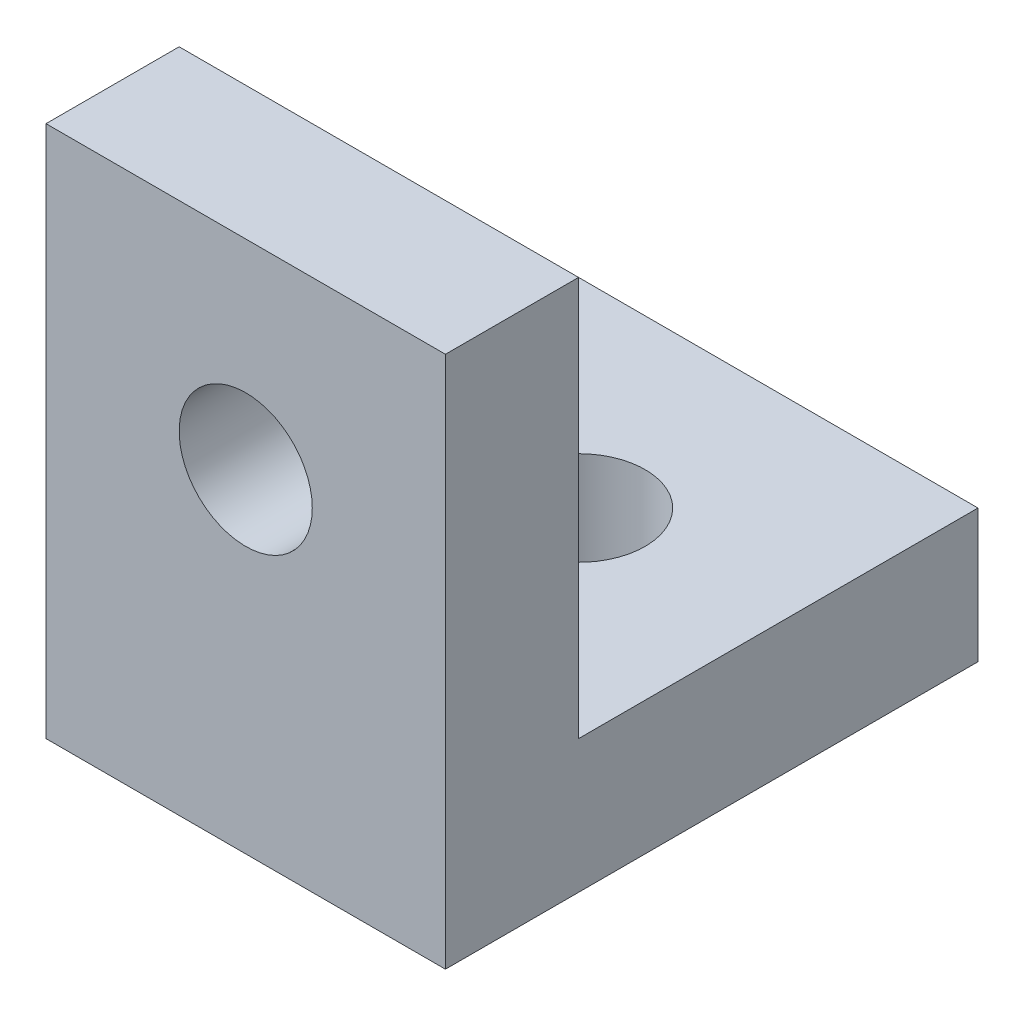
ISO-10303-21;
HEADER;
FILE_DESCRIPTION(('STEP AP214'),'2;1');
FILE_NAME('part.step','',(''),(''),'','','');
FILE_SCHEMA(('AUTOMOTIVE_DESIGN { 1 0 10303 214 1 1 1 1 }'));
ENDSEC;
DATA;
#1=APPLICATION_CONTEXT('core data for automotive mechanical design processes');
#2=APPLICATION_PROTOCOL_DEFINITION('international standard','automotive_design',2000,#1);
#3=PRODUCT_CONTEXT('',#1,'mechanical');
#4=PRODUCT('Part','Part','',(#3));
#5=PRODUCT_RELATED_PRODUCT_CATEGORY('part','',(#4));
#6=PRODUCT_DEFINITION_FORMATION('','',#4);
#7=PRODUCT_DEFINITION_CONTEXT('part definition',#1,'design');
#8=PRODUCT_DEFINITION('design','',#6,#7);
#9=PRODUCT_DEFINITION_SHAPE('','',#8);
#10=(LENGTH_UNIT() NAMED_UNIT(*) SI_UNIT(.MILLI.,.METRE.));
#11=(NAMED_UNIT(*) PLANE_ANGLE_UNIT() SI_UNIT($,.RADIAN.));
#12=(NAMED_UNIT(*) SI_UNIT($,.STERADIAN.) SOLID_ANGLE_UNIT());
#13=UNCERTAINTY_MEASURE_WITH_UNIT(LENGTH_MEASURE(1.E-05),#10,'distance_accuracy_value','');
#14=(GEOMETRIC_REPRESENTATION_CONTEXT(3) GLOBAL_UNCERTAINTY_ASSIGNED_CONTEXT((#13)) GLOBAL_UNIT_ASSIGNED_CONTEXT((#10,
#11,#12)) REPRESENTATION_CONTEXT('',''));
#15=CARTESIAN_POINT('',(0.,0.,0.));
#16=DIRECTION('',(0.,0.,1.));
#17=DIRECTION('',(1.,0.,0.));
#18=AXIS2_PLACEMENT_3D('',#15,#16,#17);
#19=CARTESIAN_POINT('',(0.,10.,0.));
#20=DIRECTION('',(1.,0.,0.));
#21=DIRECTION('',(0.,0.,-1.));
#22=AXIS2_PLACEMENT_3D('',#19,#20,#21);
#23=PLANE('',#22);
#24=DIRECTION('',(0.,0.,1.));
#25=VECTOR('',#24,1.);
#26=CARTESIAN_POINT('',(0.,0.,0.));
#27=LINE('',#26,#25);
#28=CARTESIAN_POINT('',(0.,0.,-30.));
#29=VERTEX_POINT('',#28);
#30=CARTESIAN_POINT('',(0.,0.,9.99999999999999));
#31=VERTEX_POINT('',#30);
#32=EDGE_CURVE('E113',#29,#31,#27,.T.);
#33=ORIENTED_EDGE('',*,*,#32,.T.);
#34=DIRECTION('',(0.,-1.,0.));
#35=VECTOR('',#34,1.);
#36=CARTESIAN_POINT('',(0.,0.,9.99999999999999));
#37=LINE('',#36,#35);
#38=CARTESIAN_POINT('',(0.,40.,10.));
#39=VERTEX_POINT('',#38);
#40=EDGE_CURVE('E143',#39,#31,#37,.T.);
#41=ORIENTED_EDGE('',*,*,#40,.F.);
#42=DIRECTION('',(0.,0.,-1.));
#43=VECTOR('',#42,1.);
#44=CARTESIAN_POINT('',(0.,40.,10.));
#45=LINE('',#44,#43);
#46=CARTESIAN_POINT('',(0.,40.,0.));
#47=VERTEX_POINT('',#46);
#48=EDGE_CURVE('E163',#39,#47,#45,.T.);
#49=ORIENTED_EDGE('',*,*,#48,.T.);
#50=DIRECTION('',(0.,-1.,0.));
#51=VECTOR('',#50,1.);
#52=CARTESIAN_POINT('',(0.,0.,0.));
#53=LINE('',#52,#51);
#54=CARTESIAN_POINT('',(0.,10.,0.));
#55=VERTEX_POINT('',#54);
#56=EDGE_CURVE('E97',#47,#55,#53,.T.);
#57=ORIENTED_EDGE('',*,*,#56,.T.);
#58=DIRECTION('',(0.,0.,1.));
#59=VECTOR('',#58,1.);
#60=CARTESIAN_POINT('',(0.,10.,0.));
#61=LINE('',#60,#59);
#62=CARTESIAN_POINT('',(0.,10.,-30.));
#63=VERTEX_POINT('',#62);
#64=EDGE_CURVE('E102',#63,#55,#61,.T.);
#65=ORIENTED_EDGE('',*,*,#64,.F.);
#66=DIRECTION('',(0.,-1.,0.));
#67=VECTOR('',#66,1.);
#68=CARTESIAN_POINT('',(0.,10.,-30.));
#69=LINE('',#68,#67);
#70=EDGE_CURVE('E49',#63,#29,#69,.T.);
#71=ORIENTED_EDGE('',*,*,#70,.T.);
#72=EDGE_LOOP('',(#33,#41,#49,#57,#65,#71));
#73=FACE_BOUND('',#72,.T.);
#74=ADVANCED_FACE('F40',(#73),#23,.F.);
#75=CARTESIAN_POINT('',(30.,10.,0.));
#76=DIRECTION('',(-1.,0.,0.));
#77=DIRECTION('',(0.,0.,1.));
#78=AXIS2_PLACEMENT_3D('',#75,#76,#77);
#79=PLANE('',#78);
#80=DIRECTION('',(0.,0.,-1.));
#81=VECTOR('',#80,1.);
#82=CARTESIAN_POINT('',(30.,0.,0.));
#83=LINE('',#82,#81);
#84=CARTESIAN_POINT('',(30.,0.,9.99999999999999));
#85=VERTEX_POINT('',#84);
#86=CARTESIAN_POINT('',(30.,0.,-30.));
#87=VERTEX_POINT('',#86);
#88=EDGE_CURVE('E69',#85,#87,#83,.T.);
#89=ORIENTED_EDGE('',*,*,#88,.T.);
#90=DIRECTION('',(0.,-1.,0.));
#91=VECTOR('',#90,1.);
#92=CARTESIAN_POINT('',(30.,10.,-30.));
#93=LINE('',#92,#91);
#94=CARTESIAN_POINT('',(30.,10.,-30.));
#95=VERTEX_POINT('',#94);
#96=EDGE_CURVE('E11',#95,#87,#93,.T.);
#97=ORIENTED_EDGE('',*,*,#96,.F.);
#98=DIRECTION('',(0.,0.,-1.));
#99=VECTOR('',#98,1.);
#100=CARTESIAN_POINT('',(30.,10.,0.));
#101=LINE('',#100,#99);
#102=CARTESIAN_POINT('',(30.,10.,0.));
#103=VERTEX_POINT('',#102);
#104=EDGE_CURVE('E100',#103,#95,#101,.T.);
#105=ORIENTED_EDGE('',*,*,#104,.F.);
#106=DIRECTION('',(0.,1.,0.));
#107=VECTOR('',#106,1.);
#108=CARTESIAN_POINT('',(30.,0.,0.));
#109=LINE('',#108,#107);
#110=CARTESIAN_POINT('',(30.,40.,0.));
#111=VERTEX_POINT('',#110);
#112=EDGE_CURVE('E88',#103,#111,#109,.T.);
#113=ORIENTED_EDGE('',*,*,#112,.T.);
#114=DIRECTION('',(0.,0.,-1.));
#115=VECTOR('',#114,1.);
#116=CARTESIAN_POINT('',(30.,40.,10.));
#117=LINE('',#116,#115);
#118=CARTESIAN_POINT('',(30.,40.,10.));
#119=VERTEX_POINT('',#118);
#120=EDGE_CURVE('E117',#119,#111,#117,.T.);
#121=ORIENTED_EDGE('',*,*,#120,.F.);
#122=DIRECTION('',(0.,1.,0.));
#123=VECTOR('',#122,1.);
#124=CARTESIAN_POINT('',(30.,0.,9.99999999999999));
#125=LINE('',#124,#123);
#126=EDGE_CURVE('E142',#85,#119,#125,.T.);
#127=ORIENTED_EDGE('',*,*,#126,.F.);
#128=EDGE_LOOP('',(#89,#97,#105,#113,#121,#127));
#129=FACE_BOUND('',#128,.T.);
#130=ADVANCED_FACE('F105',(#129),#79,.F.);
#131=CARTESIAN_POINT('',(0.,10.,-30.));
#132=DIRECTION('',(0.,0.,1.));
#133=DIRECTION('',(1.,0.,0.));
#134=AXIS2_PLACEMENT_3D('',#131,#132,#133);
#135=PLANE('',#134);
#136=DIRECTION('',(-1.,0.,0.));
#137=VECTOR('',#136,1.);
#138=CARTESIAN_POINT('',(0.,0.,-30.));
#139=LINE('',#138,#137);
#140=EDGE_CURVE('E120',#87,#29,#139,.T.);
#141=ORIENTED_EDGE('',*,*,#140,.T.);
#142=ORIENTED_EDGE('',*,*,#70,.F.);
#143=DIRECTION('',(-1.,0.,0.));
#144=VECTOR('',#143,1.);
#145=CARTESIAN_POINT('',(0.,10.,-30.));
#146=LINE('',#145,#144);
#147=EDGE_CURVE('E57',#95,#63,#146,.T.);
#148=ORIENTED_EDGE('',*,*,#147,.F.);
#149=ORIENTED_EDGE('',*,*,#96,.T.);
#150=EDGE_LOOP('',(#141,#142,#148,#149));
#151=FACE_BOUND('',#150,.T.);
#152=ADVANCED_FACE('F201',(#151),#135,.F.);
#153=CARTESIAN_POINT('',(0.,10.,0.));
#154=DIRECTION('',(0.,-1.,0.));
#155=DIRECTION('',(0.,0.,-1.));
#156=AXIS2_PLACEMENT_3D('',#153,#154,#155);
#157=PLANE('',#156);
#158=CARTESIAN_POINT('',(15.,10.,-15.));
#159=DIRECTION('',(0.,1.,0.));
#160=DIRECTION('',(0.,0.,1.));
#161=AXIS2_PLACEMENT_3D('',#158,#159,#160);
#162=CIRCLE('',#161,5.);
#163=CARTESIAN_POINT('',(15.,10.,-10.));
#164=VERTEX_POINT('',#163);
#165=EDGE_CURVE('E215',#164,#164,#162,.T.);
#166=ORIENTED_EDGE('',*,*,#165,.F.);
#167=EDGE_LOOP('',(#166));
#168=FACE_BOUND('',#167,.T.);
#169=ORIENTED_EDGE('',*,*,#64,.T.);
#170=DIRECTION('',(1.,0.,0.));
#171=VECTOR('',#170,1.);
#172=CARTESIAN_POINT('',(0.,10.,0.));
#173=LINE('',#172,#171);
#174=EDGE_CURVE('E78',#55,#103,#173,.T.);
#175=ORIENTED_EDGE('',*,*,#174,.T.);
#176=ORIENTED_EDGE('',*,*,#104,.T.);
#177=ORIENTED_EDGE('',*,*,#147,.T.);
#178=EDGE_LOOP('',(#169,#175,#176,#177));
#179=FACE_BOUND('',#178,.T.);
#180=ADVANCED_FACE('F99',(#168,#179),#157,.F.);
#181=CARTESIAN_POINT('',(0.,0.,0.));
#182=DIRECTION('',(0.,-1.,0.));
#183=DIRECTION('',(0.,0.,-1.));
#184=AXIS2_PLACEMENT_3D('',#181,#182,#183);
#185=PLANE('',#184);
#186=CARTESIAN_POINT('',(15.,0.,-15.));
#187=DIRECTION('',(0.,1.,0.));
#188=DIRECTION('',(0.,0.,1.));
#189=AXIS2_PLACEMENT_3D('',#186,#187,#188);
#190=CIRCLE('',#189,5.);
#191=CARTESIAN_POINT('',(15.,0.,-10.));
#192=VERTEX_POINT('',#191);
#193=EDGE_CURVE('E218',#192,#192,#190,.T.);
#194=ORIENTED_EDGE('',*,*,#193,.T.);
#195=EDGE_LOOP('',(#194));
#196=FACE_BOUND('',#195,.T.);
#197=ORIENTED_EDGE('',*,*,#32,.F.);
#198=ORIENTED_EDGE('',*,*,#140,.F.);
#199=ORIENTED_EDGE('',*,*,#88,.F.);
#200=DIRECTION('',(1.,0.,0.));
#201=VECTOR('',#200,1.);
#202=CARTESIAN_POINT('',(0.,0.,9.99999999999999));
#203=LINE('',#202,#201);
#204=EDGE_CURVE('E135',#31,#85,#203,.T.);
#205=ORIENTED_EDGE('',*,*,#204,.F.);
#206=EDGE_LOOP('',(#197,#198,#199,#205));
#207=FACE_BOUND('',#206,.T.);
#208=ADVANCED_FACE('F133',(#196,#207),#185,.T.);
#209=CARTESIAN_POINT('',(0.,0.,0.));
#210=DIRECTION('',(0.,0.,-1.));
#211=DIRECTION('',(-1.,0.,0.));
#212=AXIS2_PLACEMENT_3D('',#209,#210,#211);
#213=PLANE('',#212);
#214=CARTESIAN_POINT('',(15.,25.,0.));
#215=DIRECTION('',(0.,0.,1.));
#216=DIRECTION('',(1.,0.,0.));
#217=AXIS2_PLACEMENT_3D('',#214,#215,#216);
#218=CIRCLE('',#217,5.);
#219=CARTESIAN_POINT('',(20.,25.,0.));
#220=VERTEX_POINT('',#219);
#221=EDGE_CURVE('E165',#220,#220,#218,.T.);
#222=ORIENTED_EDGE('',*,*,#221,.T.);
#223=EDGE_LOOP('',(#222));
#224=FACE_BOUND('',#223,.T.);
#225=ORIENTED_EDGE('',*,*,#174,.F.);
#226=ORIENTED_EDGE('',*,*,#56,.F.);
#227=DIRECTION('',(-1.,0.,0.));
#228=VECTOR('',#227,1.);
#229=CARTESIAN_POINT('',(0.,40.,0.));
#230=LINE('',#229,#228);
#231=EDGE_CURVE('E92',#111,#47,#230,.T.);
#232=ORIENTED_EDGE('',*,*,#231,.F.);
#233=ORIENTED_EDGE('',*,*,#112,.F.);
#234=EDGE_LOOP('',(#225,#226,#232,#233));
#235=FACE_BOUND('',#234,.T.);
#236=ADVANCED_FACE('F89',(#224,#235),#213,.T.);
#237=CARTESIAN_POINT('',(0.,40.,10.));
#238=DIRECTION('',(0.,-1.,0.));
#239=DIRECTION('',(0.,0.,-1.));
#240=AXIS2_PLACEMENT_3D('',#237,#238,#239);
#241=PLANE('',#240);
#242=ORIENTED_EDGE('',*,*,#231,.T.);
#243=ORIENTED_EDGE('',*,*,#48,.F.);
#244=DIRECTION('',(-1.,0.,0.));
#245=VECTOR('',#244,1.);
#246=CARTESIAN_POINT('',(0.,40.,10.));
#247=LINE('',#246,#245);
#248=EDGE_CURVE('E147',#119,#39,#247,.T.);
#249=ORIENTED_EDGE('',*,*,#248,.F.);
#250=ORIENTED_EDGE('',*,*,#120,.T.);
#251=EDGE_LOOP('',(#242,#243,#249,#250));
#252=FACE_BOUND('',#251,.T.);
#253=ADVANCED_FACE('F182',(#252),#241,.F.);
#254=CARTESIAN_POINT('',(0.,0.,9.99999999999999));
#255=DIRECTION('',(0.,0.,-1.));
#256=DIRECTION('',(-1.,0.,0.));
#257=AXIS2_PLACEMENT_3D('',#254,#255,#256);
#258=PLANE('',#257);
#259=CARTESIAN_POINT('',(15.,25.,9.99999999999999));
#260=DIRECTION('',(0.,0.,1.));
#261=DIRECTION('',(1.,0.,0.));
#262=AXIS2_PLACEMENT_3D('',#259,#260,#261);
#263=CIRCLE('',#262,5.);
#264=CARTESIAN_POINT('',(20.,25.,9.99999999999999));
#265=VERTEX_POINT('',#264);
#266=EDGE_CURVE('E156',#265,#265,#263,.T.);
#267=ORIENTED_EDGE('',*,*,#266,.F.);
#268=EDGE_LOOP('',(#267));
#269=FACE_BOUND('',#268,.T.);
#270=ORIENTED_EDGE('',*,*,#40,.T.);
#271=ORIENTED_EDGE('',*,*,#204,.T.);
#272=ORIENTED_EDGE('',*,*,#126,.T.);
#273=ORIENTED_EDGE('',*,*,#248,.T.);
#274=EDGE_LOOP('',(#270,#271,#272,#273));
#275=FACE_BOUND('',#274,.T.);
#276=ADVANCED_FACE('F145',(#269,#275),#258,.F.);
#277=CARTESIAN_POINT('',(15.,25.,0.));
#278=DIRECTION('',(0.,0.,1.));
#279=DIRECTION('',(1.,0.,0.));
#280=AXIS2_PLACEMENT_3D('',#277,#278,#279);
#281=CYLINDRICAL_SURFACE('',#280,5.);
#282=ORIENTED_EDGE('',*,*,#221,.F.);
#283=EDGE_LOOP('',(#282));
#284=FACE_BOUND('',#283,.T.);
#285=ORIENTED_EDGE('',*,*,#266,.T.);
#286=EDGE_LOOP('',(#285));
#287=FACE_BOUND('',#286,.T.);
#288=ADVANCED_FACE('F191',(#284,#287),#281,.F.);
#289=CARTESIAN_POINT('',(15.,0.,-15.));
#290=DIRECTION('',(0.,1.,0.));
#291=DIRECTION('',(0.,0.,1.));
#292=AXIS2_PLACEMENT_3D('',#289,#290,#291);
#293=CYLINDRICAL_SURFACE('',#292,5.);
#294=ORIENTED_EDGE('',*,*,#193,.F.);
#295=EDGE_LOOP('',(#294));
#296=FACE_BOUND('',#295,.T.);
#297=ORIENTED_EDGE('',*,*,#165,.T.);
#298=EDGE_LOOP('',(#297));
#299=FACE_BOUND('',#298,.T.);
#300=ADVANCED_FACE('F234',(#296,#299),#293,.F.);
#301=CLOSED_SHELL('',(#74,#130,#152,#180,#208,#236,#253,#276,#288,#300));
#302=MANIFOLD_SOLID_BREP('B2',#301);
#303=ADVANCED_BREP_SHAPE_REPRESENTATION('',(#18,#302),#14);
#304=SHAPE_DEFINITION_REPRESENTATION(#9,#303);
ENDSEC;
END-ISO-10303-21;
